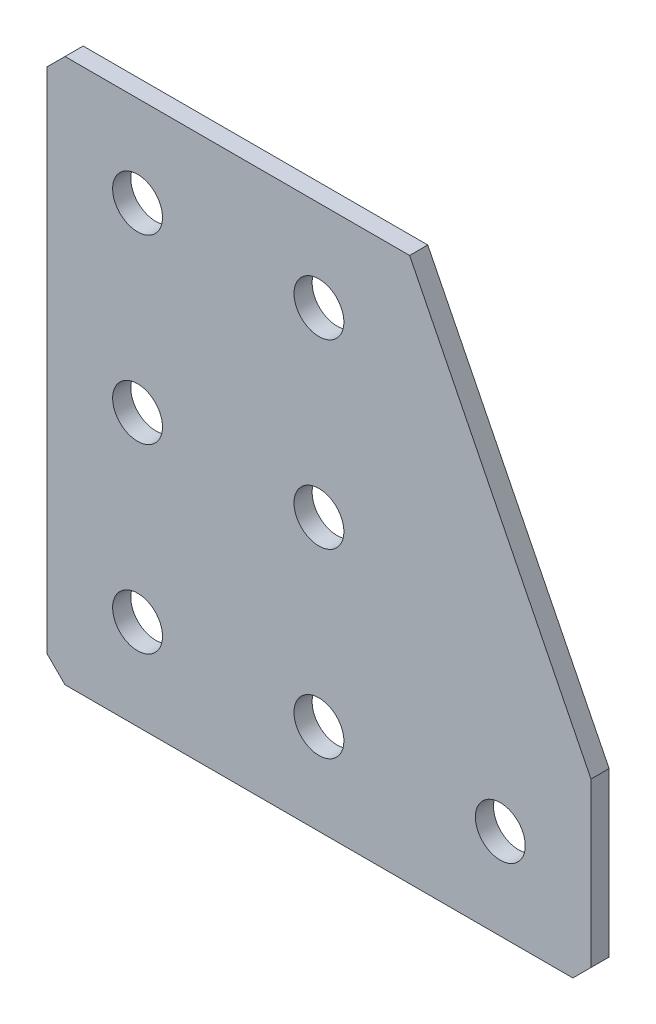
ISO-10303-21;
HEADER;
FILE_DESCRIPTION(('STEP AP214'),'2;1');
FILE_NAME('part.step','',(''),(''),'','','');
FILE_SCHEMA(('AUTOMOTIVE_DESIGN { 1 0 10303 214 1 1 1 1 }'));
ENDSEC;
DATA;
#1=APPLICATION_CONTEXT('core data for automotive mechanical design processes');
#2=APPLICATION_PROTOCOL_DEFINITION('international standard','automotive_design',2000,#1);
#3=PRODUCT_CONTEXT('',#1,'mechanical');
#4=PRODUCT('Part','Part','',(#3));
#5=PRODUCT_RELATED_PRODUCT_CATEGORY('part','',(#4));
#6=PRODUCT_DEFINITION_FORMATION('','',#4);
#7=PRODUCT_DEFINITION_CONTEXT('part definition',#1,'design');
#8=PRODUCT_DEFINITION('design','',#6,#7);
#9=PRODUCT_DEFINITION_SHAPE('','',#8);
#10=(LENGTH_UNIT() NAMED_UNIT(*) SI_UNIT(.MILLI.,.METRE.));
#11=(NAMED_UNIT(*) PLANE_ANGLE_UNIT() SI_UNIT($,.RADIAN.));
#12=(NAMED_UNIT(*) SI_UNIT($,.STERADIAN.) SOLID_ANGLE_UNIT());
#13=UNCERTAINTY_MEASURE_WITH_UNIT(LENGTH_MEASURE(1.E-05),#10,'distance_accuracy_value','');
#14=(GEOMETRIC_REPRESENTATION_CONTEXT(3) GLOBAL_UNCERTAINTY_ASSIGNED_CONTEXT((#13)) GLOBAL_UNIT_ASSIGNED_CONTEXT((#10,
#11,#12)) REPRESENTATION_CONTEXT('',''));
#15=CARTESIAN_POINT('',(0.,0.,0.));
#16=DIRECTION('',(0.,0.,1.));
#17=DIRECTION('',(1.,0.,0.));
#18=AXIS2_PLACEMENT_3D('',#15,#16,#17);
#19=CARTESIAN_POINT('',(40.,0.,-2.));
#20=DIRECTION('',(0.,-1.,0.));
#21=DIRECTION('',(1.,0.,0.));
#22=AXIS2_PLACEMENT_3D('',#19,#20,#21);
#23=PLANE('',#22);
#24=DIRECTION('',(1.,0.,0.));
#25=VECTOR('',#24,1.);
#26=CARTESIAN_POINT('',(40.,0.,-2.));
#27=LINE('',#26,#25);
#28=CARTESIAN_POINT('',(2.00000000000001,0.,-2.));
#29=VERTEX_POINT('',#28);
#30=CARTESIAN_POINT('',(40.,0.,-2.));
#31=VERTEX_POINT('',#30);
#32=EDGE_CURVE('E110',#29,#31,#27,.T.);
#33=ORIENTED_EDGE('',*,*,#32,.F.);
#34=DIRECTION('',(0.,0.,1.));
#35=VECTOR('',#34,1.);
#36=CARTESIAN_POINT('',(2.00000000000001,0.,-2.));
#37=LINE('',#36,#35);
#38=CARTESIAN_POINT('',(2.00000000000001,0.,0.));
#39=VERTEX_POINT('',#38);
#40=EDGE_CURVE('E139',#29,#39,#37,.T.);
#41=ORIENTED_EDGE('',*,*,#40,.T.);
#42=DIRECTION('',(1.,0.,0.));
#43=VECTOR('',#42,1.);
#44=CARTESIAN_POINT('',(40.,0.,0.));
#45=LINE('',#44,#43);
#46=CARTESIAN_POINT('',(40.,0.,0.));
#47=VERTEX_POINT('',#46);
#48=EDGE_CURVE('E136',#39,#47,#45,.T.);
#49=ORIENTED_EDGE('',*,*,#48,.T.);
#50=DIRECTION('',(0.,0.,1.));
#51=VECTOR('',#50,1.);
#52=CARTESIAN_POINT('',(40.,0.,-2.));
#53=LINE('',#52,#51);
#54=EDGE_CURVE('E128',#31,#47,#53,.T.);
#55=ORIENTED_EDGE('',*,*,#54,.F.);
#56=EDGE_LOOP('',(#33,#41,#49,#55));
#57=FACE_BOUND('',#56,.T.);
#58=ADVANCED_FACE('F45',(#57),#23,.F.);
#59=CARTESIAN_POINT('',(60.,-40.,-2.));
#60=DIRECTION('',(-0.894427190999916,-0.447213595499958,0.));
#61=DIRECTION('',(0.447213595499958,-0.894427190999916,0.));
#62=AXIS2_PLACEMENT_3D('',#59,#60,#61);
#63=PLANE('',#62);
#64=DIRECTION('',(0.447213595499958,-0.894427190999916,0.));
#65=VECTOR('',#64,1.);
#66=CARTESIAN_POINT('',(60.,-40.,0.));
#67=LINE('',#66,#65);
#68=CARTESIAN_POINT('',(60.,-40.,0.));
#69=VERTEX_POINT('',#68);
#70=EDGE_CURVE('E197',#47,#69,#67,.T.);
#71=ORIENTED_EDGE('',*,*,#70,.T.);
#72=DIRECTION('',(0.,0.,1.));
#73=VECTOR('',#72,1.);
#74=CARTESIAN_POINT('',(60.,-40.,-2.));
#75=LINE('',#74,#73);
#76=CARTESIAN_POINT('',(60.,-40.,-2.));
#77=VERTEX_POINT('',#76);
#78=EDGE_CURVE('E130',#77,#69,#75,.T.);
#79=ORIENTED_EDGE('',*,*,#78,.F.);
#80=DIRECTION('',(0.447213595499958,-0.894427190999916,0.));
#81=VECTOR('',#80,1.);
#82=CARTESIAN_POINT('',(60.,-40.,-2.));
#83=LINE('',#82,#81);
#84=EDGE_CURVE('E114',#31,#77,#83,.T.);
#85=ORIENTED_EDGE('',*,*,#84,.F.);
#86=ORIENTED_EDGE('',*,*,#54,.T.);
#87=EDGE_LOOP('',(#71,#79,#85,#86));
#88=FACE_BOUND('',#87,.T.);
#89=ADVANCED_FACE('F127',(#88),#63,.F.);
#90=CARTESIAN_POINT('',(60.,-60.,-2.));
#91=DIRECTION('',(-1.,0.,0.));
#92=DIRECTION('',(0.,-1.,0.));
#93=AXIS2_PLACEMENT_3D('',#90,#91,#92);
#94=PLANE('',#93);
#95=DIRECTION('',(0.,-1.,0.));
#96=VECTOR('',#95,1.);
#97=CARTESIAN_POINT('',(60.,-60.,0.));
#98=LINE('',#97,#96);
#99=CARTESIAN_POINT('',(60.,-58.,0.));
#100=VERTEX_POINT('',#99);
#101=EDGE_CURVE('E190',#69,#100,#98,.T.);
#102=ORIENTED_EDGE('',*,*,#101,.T.);
#103=DIRECTION('',(0.,0.,-1.));
#104=VECTOR('',#103,1.);
#105=CARTESIAN_POINT('',(60.,-58.,-2.));
#106=LINE('',#105,#104);
#107=CARTESIAN_POINT('',(60.,-58.,-2.));
#108=VERTEX_POINT('',#107);
#109=EDGE_CURVE('E11',#100,#108,#106,.T.);
#110=ORIENTED_EDGE('',*,*,#109,.T.);
#111=DIRECTION('',(0.,-1.,0.));
#112=VECTOR('',#111,1.);
#113=CARTESIAN_POINT('',(60.,-60.,-2.));
#114=LINE('',#113,#112);
#115=EDGE_CURVE('E133',#77,#108,#114,.T.);
#116=ORIENTED_EDGE('',*,*,#115,.F.);
#117=ORIENTED_EDGE('',*,*,#78,.T.);
#118=EDGE_LOOP('',(#102,#110,#116,#117));
#119=FACE_BOUND('',#118,.T.);
#120=ADVANCED_FACE('F307',(#119),#94,.F.);
#121=CARTESIAN_POINT('',(0.,-60.,-2.));
#122=DIRECTION('',(0.,1.,0.));
#123=DIRECTION('',(0.,0.,1.));
#124=AXIS2_PLACEMENT_3D('',#121,#122,#123);
#125=PLANE('',#124);
#126=DIRECTION('',(-1.,0.,0.));
#127=VECTOR('',#126,1.);
#128=CARTESIAN_POINT('',(0.,-60.,-2.));
#129=LINE('',#128,#127);
#130=CARTESIAN_POINT('',(58.,-60.,-2.));
#131=VERTEX_POINT('',#130);
#132=CARTESIAN_POINT('',(2.00000000000001,-60.,-2.));
#133=VERTEX_POINT('',#132);
#134=EDGE_CURVE('E182',#131,#133,#129,.T.);
#135=ORIENTED_EDGE('',*,*,#134,.F.);
#136=DIRECTION('',(0.,0.,1.));
#137=VECTOR('',#136,1.);
#138=CARTESIAN_POINT('',(58.,-60.,-2.));
#139=LINE('',#138,#137);
#140=CARTESIAN_POINT('',(58.,-60.,0.));
#141=VERTEX_POINT('',#140);
#142=EDGE_CURVE('E54',#131,#141,#139,.T.);
#143=ORIENTED_EDGE('',*,*,#142,.T.);
#144=DIRECTION('',(-1.,0.,0.));
#145=VECTOR('',#144,1.);
#146=CARTESIAN_POINT('',(0.,-60.,0.));
#147=LINE('',#146,#145);
#148=CARTESIAN_POINT('',(2.00000000000001,-60.,0.));
#149=VERTEX_POINT('',#148);
#150=EDGE_CURVE('E181',#141,#149,#147,.T.);
#151=ORIENTED_EDGE('',*,*,#150,.T.);
#152=DIRECTION('',(0.,0.,-1.));
#153=VECTOR('',#152,1.);
#154=CARTESIAN_POINT('',(2.00000000000002,-60.,-2.));
#155=LINE('',#154,#153);
#156=EDGE_CURVE('E61',#149,#133,#155,.T.);
#157=ORIENTED_EDGE('',*,*,#156,.T.);
#158=EDGE_LOOP('',(#135,#143,#151,#157));
#159=FACE_BOUND('',#158,.T.);
#160=ADVANCED_FACE('F180',(#159),#125,.F.);
#161=CARTESIAN_POINT('',(0.,0.,-2.));
#162=DIRECTION('',(1.,0.,0.));
#163=DIRECTION('',(0.,0.,-1.));
#164=AXIS2_PLACEMENT_3D('',#161,#162,#163);
#165=PLANE('',#164);
#166=DIRECTION('',(0.,1.,0.));
#167=VECTOR('',#166,1.);
#168=CARTESIAN_POINT('',(0.,0.,0.));
#169=LINE('',#168,#167);
#170=CARTESIAN_POINT('',(0.,-58.,0.));
#171=VERTEX_POINT('',#170);
#172=CARTESIAN_POINT('',(0.,-2.00000000000001,0.));
#173=VERTEX_POINT('',#172);
#174=EDGE_CURVE('E123',#171,#173,#169,.T.);
#175=ORIENTED_EDGE('',*,*,#174,.T.);
#176=DIRECTION('',(0.,0.,-1.));
#177=VECTOR('',#176,1.);
#178=CARTESIAN_POINT('',(0.,-2.00000000000002,-2.));
#179=LINE('',#178,#177);
#180=CARTESIAN_POINT('',(0.,-2.00000000000001,-2.));
#181=VERTEX_POINT('',#180);
#182=EDGE_CURVE('E163',#173,#181,#179,.T.);
#183=ORIENTED_EDGE('',*,*,#182,.T.);
#184=DIRECTION('',(0.,1.,0.));
#185=VECTOR('',#184,1.);
#186=CARTESIAN_POINT('',(0.,0.,-2.));
#187=LINE('',#186,#185);
#188=CARTESIAN_POINT('',(0.,-58.,-2.));
#189=VERTEX_POINT('',#188);
#190=EDGE_CURVE('E147',#189,#181,#187,.T.);
#191=ORIENTED_EDGE('',*,*,#190,.F.);
#192=DIRECTION('',(0.,0.,1.));
#193=VECTOR('',#192,1.);
#194=CARTESIAN_POINT('',(0.,-58.,-2.));
#195=LINE('',#194,#193);
#196=EDGE_CURVE('E159',#189,#171,#195,.T.);
#197=ORIENTED_EDGE('',*,*,#196,.T.);
#198=EDGE_LOOP('',(#175,#183,#191,#197));
#199=FACE_BOUND('',#198,.T.);
#200=ADVANCED_FACE('F273',(#199),#165,.F.);
#201=CARTESIAN_POINT('',(0.,0.,-2.));
#202=DIRECTION('',(0.,0.,1.));
#203=DIRECTION('',(1.,0.,0.));
#204=AXIS2_PLACEMENT_3D('',#201,#202,#203);
#205=PLANE('',#204);
#206=CARTESIAN_POINT('',(30.,-50.,-2.));
#207=DIRECTION('',(0.,0.,-1.));
#208=DIRECTION('',(0.,1.,0.));
#209=AXIS2_PLACEMENT_3D('',#206,#207,#208);
#210=CIRCLE('',#209,2.75);
#211=CARTESIAN_POINT('',(30.,-47.25,-2.));
#212=VERTEX_POINT('',#211);
#213=EDGE_CURVE('E262',#212,#212,#210,.T.);
#214=ORIENTED_EDGE('',*,*,#213,.F.);
#215=EDGE_LOOP('',(#214));
#216=FACE_BOUND('',#215,.T.);
#217=CARTESIAN_POINT('',(10.,-50.,-2.));
#218=DIRECTION('',(0.,0.,-1.));
#219=DIRECTION('',(0.,1.,0.));
#220=AXIS2_PLACEMENT_3D('',#217,#218,#219);
#221=CIRCLE('',#220,2.75);
#222=CARTESIAN_POINT('',(10.,-47.25,-2.));
#223=VERTEX_POINT('',#222);
#224=EDGE_CURVE('E254',#223,#223,#221,.T.);
#225=ORIENTED_EDGE('',*,*,#224,.F.);
#226=EDGE_LOOP('',(#225));
#227=FACE_BOUND('',#226,.T.);
#228=CARTESIAN_POINT('',(10.,-30.,-2.));
#229=DIRECTION('',(0.,0.,-1.));
#230=DIRECTION('',(0.,1.,0.));
#231=AXIS2_PLACEMENT_3D('',#228,#229,#230);
#232=CIRCLE('',#231,2.75);
#233=CARTESIAN_POINT('',(10.,-27.25,-2.));
#234=VERTEX_POINT('',#233);
#235=EDGE_CURVE('E246',#234,#234,#232,.T.);
#236=ORIENTED_EDGE('',*,*,#235,.F.);
#237=EDGE_LOOP('',(#236));
#238=FACE_BOUND('',#237,.T.);
#239=CARTESIAN_POINT('',(10.,-9.99999999999999,-2.));
#240=DIRECTION('',(0.,0.,-1.));
#241=DIRECTION('',(0.,1.,0.));
#242=AXIS2_PLACEMENT_3D('',#239,#240,#241);
#243=CIRCLE('',#242,2.75);
#244=CARTESIAN_POINT('',(10.,-7.24999999999999,-2.));
#245=VERTEX_POINT('',#244);
#246=EDGE_CURVE('E238',#245,#245,#243,.T.);
#247=ORIENTED_EDGE('',*,*,#246,.F.);
#248=EDGE_LOOP('',(#247));
#249=FACE_BOUND('',#248,.T.);
#250=CARTESIAN_POINT('',(50.,-50.,-2.));
#251=DIRECTION('',(0.,0.,-1.));
#252=DIRECTION('',(0.,1.,0.));
#253=AXIS2_PLACEMENT_3D('',#250,#251,#252);
#254=CIRCLE('',#253,2.75);
#255=CARTESIAN_POINT('',(50.,-47.25,-2.));
#256=VERTEX_POINT('',#255);
#257=EDGE_CURVE('E230',#256,#256,#254,.T.);
#258=ORIENTED_EDGE('',*,*,#257,.F.);
#259=EDGE_LOOP('',(#258));
#260=FACE_BOUND('',#259,.T.);
#261=CARTESIAN_POINT('',(30.,-30.,-2.));
#262=DIRECTION('',(0.,0.,-1.));
#263=DIRECTION('',(0.,1.,0.));
#264=AXIS2_PLACEMENT_3D('',#261,#262,#263);
#265=CIRCLE('',#264,2.75);
#266=CARTESIAN_POINT('',(30.,-27.25,-2.));
#267=VERTEX_POINT('',#266);
#268=EDGE_CURVE('E222',#267,#267,#265,.T.);
#269=ORIENTED_EDGE('',*,*,#268,.F.);
#270=EDGE_LOOP('',(#269));
#271=FACE_BOUND('',#270,.T.);
#272=CARTESIAN_POINT('',(30.,-9.99999999999999,-2.));
#273=DIRECTION('',(0.,0.,-1.));
#274=DIRECTION('',(0.,1.,0.));
#275=AXIS2_PLACEMENT_3D('',#272,#273,#274);
#276=CIRCLE('',#275,2.75);
#277=CARTESIAN_POINT('',(30.,-7.24999999999999,-2.));
#278=VERTEX_POINT('',#277);
#279=EDGE_CURVE('E214',#278,#278,#276,.T.);
#280=ORIENTED_EDGE('',*,*,#279,.F.);
#281=EDGE_LOOP('',(#280));
#282=FACE_BOUND('',#281,.T.);
#283=ORIENTED_EDGE('',*,*,#190,.T.);
#284=DIRECTION('',(-0.707106781186546,-0.707106781186549,0.));
#285=VECTOR('',#284,1.);
#286=CARTESIAN_POINT('',(2.00000000000001,0.,-2.));
#287=LINE('',#286,#285);
#288=EDGE_CURVE('E117',#181,#29,#287,.F.);
#289=ORIENTED_EDGE('',*,*,#288,.T.);
#290=ORIENTED_EDGE('',*,*,#32,.T.);
#291=ORIENTED_EDGE('',*,*,#84,.T.);
#292=ORIENTED_EDGE('',*,*,#115,.T.);
#293=DIRECTION('',(0.707106781186546,0.707106781186549,0.));
#294=VECTOR('',#293,1.);
#295=CARTESIAN_POINT('',(58.,-60.,-2.));
#296=LINE('',#295,#294);
#297=EDGE_CURVE('E68',#108,#131,#296,.F.);
#298=ORIENTED_EDGE('',*,*,#297,.T.);
#299=ORIENTED_EDGE('',*,*,#134,.T.);
#300=DIRECTION('',(0.707106781186549,-0.707106781186546,0.));
#301=VECTOR('',#300,1.);
#302=CARTESIAN_POINT('',(0.,-58.,-2.));
#303=LINE('',#302,#301);
#304=EDGE_CURVE('E166',#133,#189,#303,.F.);
#305=ORIENTED_EDGE('',*,*,#304,.T.);
#306=EDGE_LOOP('',(#283,#289,#290,#291,#292,#298,#299,#305));
#307=FACE_BOUND('',#306,.T.);
#308=ADVANCED_FACE('F113',(#216,#227,#238,#249,#260,#271,#282,#307),#205,.F.);
#309=CARTESIAN_POINT('',(0.,0.,0.));
#310=DIRECTION('',(0.,0.,1.));
#311=DIRECTION('',(1.,0.,0.));
#312=AXIS2_PLACEMENT_3D('',#309,#310,#311);
#313=PLANE('',#312);
#314=CARTESIAN_POINT('',(30.,-50.,0.));
#315=DIRECTION('',(0.,0.,-1.));
#316=DIRECTION('',(0.,1.,0.));
#317=AXIS2_PLACEMENT_3D('',#314,#315,#316);
#318=CIRCLE('',#317,2.75);
#319=CARTESIAN_POINT('',(30.,-47.25,0.));
#320=VERTEX_POINT('',#319);
#321=EDGE_CURVE('E258',#320,#320,#318,.T.);
#322=ORIENTED_EDGE('',*,*,#321,.T.);
#323=EDGE_LOOP('',(#322));
#324=FACE_BOUND('',#323,.T.);
#325=CARTESIAN_POINT('',(10.,-50.,0.));
#326=DIRECTION('',(0.,0.,-1.));
#327=DIRECTION('',(0.,1.,0.));
#328=AXIS2_PLACEMENT_3D('',#325,#326,#327);
#329=CIRCLE('',#328,2.75);
#330=CARTESIAN_POINT('',(10.,-47.25,0.));
#331=VERTEX_POINT('',#330);
#332=EDGE_CURVE('E250',#331,#331,#329,.T.);
#333=ORIENTED_EDGE('',*,*,#332,.T.);
#334=EDGE_LOOP('',(#333));
#335=FACE_BOUND('',#334,.T.);
#336=CARTESIAN_POINT('',(10.,-30.,0.));
#337=DIRECTION('',(0.,0.,-1.));
#338=DIRECTION('',(0.,1.,0.));
#339=AXIS2_PLACEMENT_3D('',#336,#337,#338);
#340=CIRCLE('',#339,2.75);
#341=CARTESIAN_POINT('',(10.,-27.25,0.));
#342=VERTEX_POINT('',#341);
#343=EDGE_CURVE('E242',#342,#342,#340,.T.);
#344=ORIENTED_EDGE('',*,*,#343,.T.);
#345=EDGE_LOOP('',(#344));
#346=FACE_BOUND('',#345,.T.);
#347=CARTESIAN_POINT('',(10.,-9.99999999999999,0.));
#348=DIRECTION('',(0.,0.,-1.));
#349=DIRECTION('',(0.,1.,0.));
#350=AXIS2_PLACEMENT_3D('',#347,#348,#349);
#351=CIRCLE('',#350,2.75);
#352=CARTESIAN_POINT('',(10.,-7.24999999999999,0.));
#353=VERTEX_POINT('',#352);
#354=EDGE_CURVE('E234',#353,#353,#351,.T.);
#355=ORIENTED_EDGE('',*,*,#354,.T.);
#356=EDGE_LOOP('',(#355));
#357=FACE_BOUND('',#356,.T.);
#358=CARTESIAN_POINT('',(50.,-50.,0.));
#359=DIRECTION('',(0.,0.,-1.));
#360=DIRECTION('',(0.,1.,0.));
#361=AXIS2_PLACEMENT_3D('',#358,#359,#360);
#362=CIRCLE('',#361,2.75);
#363=CARTESIAN_POINT('',(50.,-47.25,0.));
#364=VERTEX_POINT('',#363);
#365=EDGE_CURVE('E226',#364,#364,#362,.T.);
#366=ORIENTED_EDGE('',*,*,#365,.T.);
#367=EDGE_LOOP('',(#366));
#368=FACE_BOUND('',#367,.T.);
#369=CARTESIAN_POINT('',(30.,-30.,0.));
#370=DIRECTION('',(0.,0.,-1.));
#371=DIRECTION('',(0.,1.,0.));
#372=AXIS2_PLACEMENT_3D('',#369,#370,#371);
#373=CIRCLE('',#372,2.75);
#374=CARTESIAN_POINT('',(30.,-27.25,0.));
#375=VERTEX_POINT('',#374);
#376=EDGE_CURVE('E218',#375,#375,#373,.T.);
#377=ORIENTED_EDGE('',*,*,#376,.T.);
#378=EDGE_LOOP('',(#377));
#379=FACE_BOUND('',#378,.T.);
#380=CARTESIAN_POINT('',(30.,-9.99999999999999,0.));
#381=DIRECTION('',(0.,0.,-1.));
#382=DIRECTION('',(0.,1.,0.));
#383=AXIS2_PLACEMENT_3D('',#380,#381,#382);
#384=CIRCLE('',#383,2.75);
#385=CARTESIAN_POINT('',(30.,-7.24999999999999,0.));
#386=VERTEX_POINT('',#385);
#387=EDGE_CURVE('E204',#386,#386,#384,.T.);
#388=ORIENTED_EDGE('',*,*,#387,.T.);
#389=EDGE_LOOP('',(#388));
#390=FACE_BOUND('',#389,.T.);
#391=ORIENTED_EDGE('',*,*,#48,.F.);
#392=DIRECTION('',(0.707106781186546,0.707106781186549,0.));
#393=VECTOR('',#392,1.);
#394=CARTESIAN_POINT('',(1.00000000000001,-1.,0.));
#395=LINE('',#394,#393);
#396=EDGE_CURVE('E156',#39,#173,#395,.F.);
#397=ORIENTED_EDGE('',*,*,#396,.T.);
#398=ORIENTED_EDGE('',*,*,#174,.F.);
#399=DIRECTION('',(-0.707106781186549,0.707106781186546,0.));
#400=VECTOR('',#399,1.);
#401=CARTESIAN_POINT('',(-29.,-29.0000000000001,0.));
#402=LINE('',#401,#400);
#403=EDGE_CURVE('E145',#171,#149,#402,.F.);
#404=ORIENTED_EDGE('',*,*,#403,.T.);
#405=ORIENTED_EDGE('',*,*,#150,.F.);
#406=DIRECTION('',(-0.707106781186546,-0.707106781186549,0.));
#407=VECTOR('',#406,1.);
#408=CARTESIAN_POINT('',(59.0000000000001,-58.9999999999999,0.));
#409=LINE('',#408,#407);
#410=EDGE_CURVE('E153',#141,#100,#409,.F.);
#411=ORIENTED_EDGE('',*,*,#410,.T.);
#412=ORIENTED_EDGE('',*,*,#101,.F.);
#413=ORIENTED_EDGE('',*,*,#70,.F.);
#414=EDGE_LOOP('',(#391,#397,#398,#404,#405,#411,#412,#413));
#415=FACE_BOUND('',#414,.T.);
#416=ADVANCED_FACE('F185',(#324,#335,#346,#357,#368,#379,#390,#415),#313,.T.);
#417=CARTESIAN_POINT('',(30.,-9.99999999999999,-2.));
#418=DIRECTION('',(0.,0.,-1.));
#419=DIRECTION('',(0.,1.,0.));
#420=AXIS2_PLACEMENT_3D('',#417,#418,#419);
#421=CYLINDRICAL_SURFACE('',#420,2.75);
#422=ORIENTED_EDGE('',*,*,#387,.F.);
#423=EDGE_LOOP('',(#422));
#424=FACE_BOUND('',#423,.T.);
#425=ORIENTED_EDGE('',*,*,#279,.T.);
#426=EDGE_LOOP('',(#425));
#427=FACE_BOUND('',#426,.T.);
#428=ADVANCED_FACE('F287',(#424,#427),#421,.F.);
#429=CARTESIAN_POINT('',(30.,-30.,-2.));
#430=DIRECTION('',(0.,0.,-1.));
#431=DIRECTION('',(0.,1.,0.));
#432=AXIS2_PLACEMENT_3D('',#429,#430,#431);
#433=CYLINDRICAL_SURFACE('',#432,2.75);
#434=ORIENTED_EDGE('',*,*,#376,.F.);
#435=EDGE_LOOP('',(#434));
#436=FACE_BOUND('',#435,.T.);
#437=ORIENTED_EDGE('',*,*,#268,.T.);
#438=EDGE_LOOP('',(#437));
#439=FACE_BOUND('',#438,.T.);
#440=ADVANCED_FACE('F289',(#436,#439),#433,.F.);
#441=CARTESIAN_POINT('',(50.,-50.,-2.));
#442=DIRECTION('',(0.,0.,-1.));
#443=DIRECTION('',(0.,1.,0.));
#444=AXIS2_PLACEMENT_3D('',#441,#442,#443);
#445=CYLINDRICAL_SURFACE('',#444,2.75);
#446=ORIENTED_EDGE('',*,*,#365,.F.);
#447=EDGE_LOOP('',(#446));
#448=FACE_BOUND('',#447,.T.);
#449=ORIENTED_EDGE('',*,*,#257,.T.);
#450=EDGE_LOOP('',(#449));
#451=FACE_BOUND('',#450,.T.);
#452=ADVANCED_FACE('F296',(#448,#451),#445,.F.);
#453=CARTESIAN_POINT('',(10.,-9.99999999999999,-2.));
#454=DIRECTION('',(0.,0.,-1.));
#455=DIRECTION('',(0.,1.,0.));
#456=AXIS2_PLACEMENT_3D('',#453,#454,#455);
#457=CYLINDRICAL_SURFACE('',#456,2.75);
#458=ORIENTED_EDGE('',*,*,#354,.F.);
#459=EDGE_LOOP('',(#458));
#460=FACE_BOUND('',#459,.T.);
#461=ORIENTED_EDGE('',*,*,#246,.T.);
#462=EDGE_LOOP('',(#461));
#463=FACE_BOUND('',#462,.T.);
#464=ADVANCED_FACE('F371',(#460,#463),#457,.F.);
#465=CARTESIAN_POINT('',(10.,-30.,-2.));
#466=DIRECTION('',(0.,0.,-1.));
#467=DIRECTION('',(0.,1.,0.));
#468=AXIS2_PLACEMENT_3D('',#465,#466,#467);
#469=CYLINDRICAL_SURFACE('',#468,2.75);
#470=ORIENTED_EDGE('',*,*,#343,.F.);
#471=EDGE_LOOP('',(#470));
#472=FACE_BOUND('',#471,.T.);
#473=ORIENTED_EDGE('',*,*,#235,.T.);
#474=EDGE_LOOP('',(#473));
#475=FACE_BOUND('',#474,.T.);
#476=ADVANCED_FACE('F380',(#472,#475),#469,.F.);
#477=CARTESIAN_POINT('',(10.,-50.,-2.));
#478=DIRECTION('',(0.,0.,-1.));
#479=DIRECTION('',(0.,1.,0.));
#480=AXIS2_PLACEMENT_3D('',#477,#478,#479);
#481=CYLINDRICAL_SURFACE('',#480,2.75);
#482=ORIENTED_EDGE('',*,*,#332,.F.);
#483=EDGE_LOOP('',(#482));
#484=FACE_BOUND('',#483,.T.);
#485=ORIENTED_EDGE('',*,*,#224,.T.);
#486=EDGE_LOOP('',(#485));
#487=FACE_BOUND('',#486,.T.);
#488=ADVANCED_FACE('F389',(#484,#487),#481,.F.);
#489=CARTESIAN_POINT('',(30.,-50.,-2.));
#490=DIRECTION('',(0.,0.,-1.));
#491=DIRECTION('',(0.,1.,0.));
#492=AXIS2_PLACEMENT_3D('',#489,#490,#491);
#493=CYLINDRICAL_SURFACE('',#492,2.75);
#494=ORIENTED_EDGE('',*,*,#321,.F.);
#495=EDGE_LOOP('',(#494));
#496=FACE_BOUND('',#495,.T.);
#497=ORIENTED_EDGE('',*,*,#213,.T.);
#498=EDGE_LOOP('',(#497));
#499=FACE_BOUND('',#498,.T.);
#500=ADVANCED_FACE('F269',(#496,#499),#493,.F.);
#501=CARTESIAN_POINT('',(2.00000000000001,0.,-2.));
#502=DIRECTION('',(0.707106781186549,-0.707106781186546,0.));
#503=DIRECTION('',(0.,0.,1.));
#504=AXIS2_PLACEMENT_3D('',#501,#502,#503);
#505=PLANE('',#504);
#506=ORIENTED_EDGE('',*,*,#288,.F.);
#507=ORIENTED_EDGE('',*,*,#182,.F.);
#508=ORIENTED_EDGE('',*,*,#396,.F.);
#509=ORIENTED_EDGE('',*,*,#40,.F.);
#510=EDGE_LOOP('',(#506,#507,#508,#509));
#511=FACE_BOUND('',#510,.T.);
#512=ADVANCED_FACE('F311',(#511),#505,.F.);
#513=CARTESIAN_POINT('',(58.,-60.,-2.));
#514=DIRECTION('',(-0.707106781186549,0.707106781186546,0.));
#515=DIRECTION('',(0.,0.,1.));
#516=AXIS2_PLACEMENT_3D('',#513,#514,#515);
#517=PLANE('',#516);
#518=ORIENTED_EDGE('',*,*,#297,.F.);
#519=ORIENTED_EDGE('',*,*,#109,.F.);
#520=ORIENTED_EDGE('',*,*,#410,.F.);
#521=ORIENTED_EDGE('',*,*,#142,.F.);
#522=EDGE_LOOP('',(#518,#519,#520,#521));
#523=FACE_BOUND('',#522,.T.);
#524=ADVANCED_FACE('F313',(#523),#517,.F.);
#525=CARTESIAN_POINT('',(0.,-58.,-2.));
#526=DIRECTION('',(0.707106781186546,0.707106781186549,0.));
#527=DIRECTION('',(0.,0.,1.));
#528=AXIS2_PLACEMENT_3D('',#525,#526,#527);
#529=PLANE('',#528);
#530=ORIENTED_EDGE('',*,*,#304,.F.);
#531=ORIENTED_EDGE('',*,*,#156,.F.);
#532=ORIENTED_EDGE('',*,*,#403,.F.);
#533=ORIENTED_EDGE('',*,*,#196,.F.);
#534=EDGE_LOOP('',(#530,#531,#532,#533));
#535=FACE_BOUND('',#534,.T.);
#536=ADVANCED_FACE('F47',(#535),#529,.F.);
#537=CLOSED_SHELL('',(#58,#89,#120,#160,#200,#308,#416,#428,#440,#452,#464,#476,#488,#500,#512,
#524,#536));
#538=MANIFOLD_SOLID_BREP('B2',#537);
#539=ADVANCED_BREP_SHAPE_REPRESENTATION('',(#18,#538),#14);
#540=SHAPE_DEFINITION_REPRESENTATION(#9,#539);
ENDSEC;
END-ISO-10303-21;
